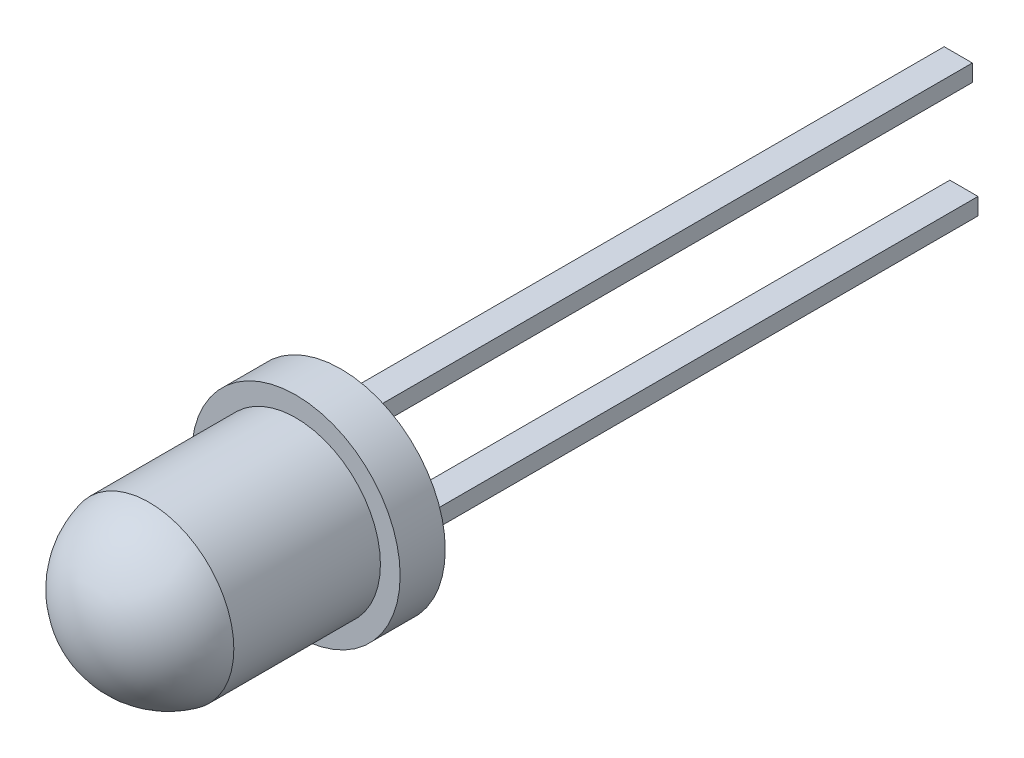
ISO-10303-21;
HEADER;
FILE_DESCRIPTION(('STEP AP214'),'2;1');
FILE_NAME('part.step','',(''),(''),'','','');
FILE_SCHEMA(('AUTOMOTIVE_DESIGN { 1 0 10303 214 1 1 1 1 }'));
ENDSEC;
DATA;
#1=APPLICATION_CONTEXT('core data for automotive mechanical design processes');
#2=APPLICATION_PROTOCOL_DEFINITION('international standard','automotive_design',2000,#1);
#3=PRODUCT_CONTEXT('',#1,'mechanical');
#4=PRODUCT('Part','Part','',(#3));
#5=PRODUCT_RELATED_PRODUCT_CATEGORY('part','',(#4));
#6=PRODUCT_DEFINITION_FORMATION('','',#4);
#7=PRODUCT_DEFINITION_CONTEXT('part definition',#1,'design');
#8=PRODUCT_DEFINITION('design','',#6,#7);
#9=PRODUCT_DEFINITION_SHAPE('','',#8);
#10=(LENGTH_UNIT() NAMED_UNIT(*) SI_UNIT(.MILLI.,.METRE.));
#11=(NAMED_UNIT(*) PLANE_ANGLE_UNIT() SI_UNIT($,.RADIAN.));
#12=(NAMED_UNIT(*) SI_UNIT($,.STERADIAN.) SOLID_ANGLE_UNIT());
#13=UNCERTAINTY_MEASURE_WITH_UNIT(LENGTH_MEASURE(1.E-05),#10,'distance_accuracy_value','');
#14=(GEOMETRIC_REPRESENTATION_CONTEXT(3) GLOBAL_UNCERTAINTY_ASSIGNED_CONTEXT((#13)) GLOBAL_UNIT_ASSIGNED_CONTEXT((#10,
#11,#12)) REPRESENTATION_CONTEXT('',''));
#15=CARTESIAN_POINT('',(0.,0.,0.));
#16=DIRECTION('',(0.,0.,1.));
#17=DIRECTION('',(1.,0.,0.));
#18=AXIS2_PLACEMENT_3D('',#15,#16,#17);
#19=CARTESIAN_POINT('',(0.,0.,1.3));
#20=DIRECTION('',(0.,0.,-1.));
#21=DIRECTION('',(-1.,0.,0.));
#22=AXIS2_PLACEMENT_3D('',#19,#20,#21);
#23=CYLINDRICAL_SURFACE('',#22,1.5);
#24=CARTESIAN_POINT('',(0.,0.,1.3));
#25=DIRECTION('',(0.,0.,1.));
#26=DIRECTION('',(1.,0.,0.));
#27=AXIS2_PLACEMENT_3D('',#24,#25,#26);
#28=CIRCLE('',#27,1.5);
#29=CARTESIAN_POINT('',(1.5,0.,1.3));
#30=VERTEX_POINT('',#29);
#31=EDGE_CURVE('E11',#30,#30,#28,.T.);
#32=ORIENTED_EDGE('',*,*,#31,.F.);
#33=EDGE_LOOP('',(#32));
#34=FACE_BOUND('',#33,.T.);
#35=CARTESIAN_POINT('',(0.,0.,-1.3));
#36=DIRECTION('',(0.,0.,1.));
#37=DIRECTION('',(1.,0.,0.));
#38=AXIS2_PLACEMENT_3D('',#35,#36,#37);
#39=CIRCLE('',#38,1.5);
#40=CARTESIAN_POINT('',(1.5,0.,-1.3));
#41=VERTEX_POINT('',#40);
#42=EDGE_CURVE('E49',#41,#41,#39,.T.);
#43=ORIENTED_EDGE('',*,*,#42,.T.);
#44=EDGE_LOOP('',(#43));
#45=FACE_BOUND('',#44,.T.);
#46=ADVANCED_FACE('F40',(#34,#45),#23,.T.);
#47=CARTESIAN_POINT('',(0.,0.,0.9625));
#48=DIRECTION('',(0.,0.,1.));
#49=DIRECTION('',(1.,0.,0.));
#50=AXIS2_PLACEMENT_3D('',#47,#48,#49);
#51=SPHERICAL_SURFACE('',#50,1.5375);
#52=ORIENTED_EDGE('',*,*,#31,.T.);
#53=EDGE_LOOP('',(#52));
#54=FACE_BOUND('',#53,.T.);
#55=ADVANCED_FACE('F42',(#54),#51,.T.);
#56=CARTESIAN_POINT('',(0.,0.,-2.1));
#57=DIRECTION('',(0.,0.,1.));
#58=DIRECTION('',(1.,0.,0.));
#59=AXIS2_PLACEMENT_3D('',#56,#57,#58);
#60=CYLINDRICAL_SURFACE('',#59,1.85);
#61=CARTESIAN_POINT('',(0.,0.,-2.1));
#62=DIRECTION('',(0.,0.,1.));
#63=DIRECTION('',(1.,0.,0.));
#64=AXIS2_PLACEMENT_3D('',#61,#62,#63);
#65=CIRCLE('',#64,1.85);
#66=CARTESIAN_POINT('',(1.85,0.,-2.1));
#67=VERTEX_POINT('',#66);
#68=EDGE_CURVE('E139',#67,#67,#65,.T.);
#69=ORIENTED_EDGE('',*,*,#68,.T.);
#70=EDGE_LOOP('',(#69));
#71=FACE_BOUND('',#70,.T.);
#72=CARTESIAN_POINT('',(0.,0.,-1.3));
#73=DIRECTION('',(0.,0.,1.));
#74=DIRECTION('',(1.,0.,0.));
#75=AXIS2_PLACEMENT_3D('',#72,#73,#74);
#76=CIRCLE('',#75,1.85);
#77=CARTESIAN_POINT('',(1.85,0.,-1.3));
#78=VERTEX_POINT('',#77);
#79=EDGE_CURVE('E143',#78,#78,#76,.T.);
#80=ORIENTED_EDGE('',*,*,#79,.F.);
#81=EDGE_LOOP('',(#80));
#82=FACE_BOUND('',#81,.T.);
#83=ADVANCED_FACE('F158',(#71,#82),#60,.T.);
#84=CARTESIAN_POINT('',(0.,0.,-2.1));
#85=DIRECTION('',(0.,0.,1.));
#86=DIRECTION('',(1.,0.,0.));
#87=AXIS2_PLACEMENT_3D('',#84,#85,#86);
#88=PLANE('',#87);
#89=DIRECTION('',(0.,-1.,0.));
#90=VECTOR('',#89,1.);
#91=CARTESIAN_POINT('',(-1.3,0.,-2.1));
#92=LINE('',#91,#90);
#93=CARTESIAN_POINT('',(-1.3,0.15,-2.1));
#94=VERTEX_POINT('',#93);
#95=CARTESIAN_POINT('',(-1.3,-0.15,-2.1));
#96=VERTEX_POINT('',#95);
#97=EDGE_CURVE('E315',#94,#96,#92,.T.);
#98=ORIENTED_EDGE('',*,*,#97,.T.);
#99=DIRECTION('',(1.,0.,0.));
#100=VECTOR('',#99,1.);
#101=CARTESIAN_POINT('',(0.,-0.15,-2.1));
#102=LINE('',#101,#100);
#103=CARTESIAN_POINT('',(-0.8,-0.15,-2.1));
#104=VERTEX_POINT('',#103);
#105=EDGE_CURVE('E326',#96,#104,#102,.T.);
#106=ORIENTED_EDGE('',*,*,#105,.T.);
#107=DIRECTION('',(0.,1.,0.));
#108=VECTOR('',#107,1.);
#109=CARTESIAN_POINT('',(-0.8,0.,-2.1));
#110=LINE('',#109,#108);
#111=CARTESIAN_POINT('',(-0.8,0.15,-2.1));
#112=VERTEX_POINT('',#111);
#113=EDGE_CURVE('E322',#104,#112,#110,.T.);
#114=ORIENTED_EDGE('',*,*,#113,.T.);
#115=DIRECTION('',(-1.,0.,0.));
#116=VECTOR('',#115,1.);
#117=CARTESIAN_POINT('',(0.,0.15,-2.1));
#118=LINE('',#117,#116);
#119=EDGE_CURVE('E64',#112,#94,#118,.T.);
#120=ORIENTED_EDGE('',*,*,#119,.T.);
#121=EDGE_LOOP('',(#98,#106,#114,#120));
#122=FACE_BOUND('',#121,.T.);
#123=DIRECTION('',(0.,-1.,0.));
#124=VECTOR('',#123,1.);
#125=CARTESIAN_POINT('',(0.8,0.,-2.1));
#126=LINE('',#125,#124);
#127=CARTESIAN_POINT('',(0.8,0.15,-2.1));
#128=VERTEX_POINT('',#127);
#129=CARTESIAN_POINT('',(0.8,-0.15,-2.1));
#130=VERTEX_POINT('',#129);
#131=EDGE_CURVE('E128',#128,#130,#126,.T.);
#132=ORIENTED_EDGE('',*,*,#131,.T.);
#133=DIRECTION('',(1.,0.,0.));
#134=VECTOR('',#133,1.);
#135=CARTESIAN_POINT('',(0.,-0.15,-2.1));
#136=LINE('',#135,#134);
#137=CARTESIAN_POINT('',(1.3,-0.15,-2.1));
#138=VERTEX_POINT('',#137);
#139=EDGE_CURVE('E299',#130,#138,#136,.T.);
#140=ORIENTED_EDGE('',*,*,#139,.T.);
#141=DIRECTION('',(0.,1.,0.));
#142=VECTOR('',#141,1.);
#143=CARTESIAN_POINT('',(1.3,0.,-2.1));
#144=LINE('',#143,#142);
#145=CARTESIAN_POINT('',(1.3,0.15,-2.1));
#146=VERTEX_POINT('',#145);
#147=EDGE_CURVE('E124',#138,#146,#144,.T.);
#148=ORIENTED_EDGE('',*,*,#147,.T.);
#149=DIRECTION('',(-1.,0.,0.));
#150=VECTOR('',#149,1.);
#151=CARTESIAN_POINT('',(0.,0.15,-2.1));
#152=LINE('',#151,#150);
#153=EDGE_CURVE('E135',#146,#128,#152,.T.);
#154=ORIENTED_EDGE('',*,*,#153,.T.);
#155=EDGE_LOOP('',(#132,#140,#148,#154));
#156=FACE_BOUND('',#155,.T.);
#157=ORIENTED_EDGE('',*,*,#68,.F.);
#158=EDGE_LOOP('',(#157));
#159=FACE_BOUND('',#158,.T.);
#160=ADVANCED_FACE('F154',(#122,#156,#159),#88,.F.);
#161=CARTESIAN_POINT('',(0.,0.,-1.3));
#162=DIRECTION('',(0.,0.,1.));
#163=DIRECTION('',(1.,0.,0.));
#164=AXIS2_PLACEMENT_3D('',#161,#162,#163);
#165=PLANE('',#164);
#166=ORIENTED_EDGE('',*,*,#42,.F.);
#167=EDGE_LOOP('',(#166));
#168=FACE_BOUND('',#167,.T.);
#169=ORIENTED_EDGE('',*,*,#79,.T.);
#170=EDGE_LOOP('',(#169));
#171=FACE_BOUND('',#170,.T.);
#172=ADVANCED_FACE('F151',(#168,#171),#165,.T.);
#173=CARTESIAN_POINT('',(0.,-0.15,-14.1));
#174=DIRECTION('',(0.,-1.,0.));
#175=DIRECTION('',(1.,0.,0.));
#176=AXIS2_PLACEMENT_3D('',#173,#174,#175);
#177=PLANE('',#176);
#178=DIRECTION('',(1.,0.,0.));
#179=VECTOR('',#178,1.);
#180=CARTESIAN_POINT('',(0.,-0.15,-12.1));
#181=LINE('',#180,#179);
#182=CARTESIAN_POINT('',(0.8,-0.15,-12.1));
#183=VERTEX_POINT('',#182);
#184=CARTESIAN_POINT('',(1.3,-0.15,-12.1));
#185=VERTEX_POINT('',#184);
#186=EDGE_CURVE('E106',#183,#185,#181,.T.);
#187=ORIENTED_EDGE('',*,*,#186,.T.);
#188=DIRECTION('',(0.,0.,1.));
#189=VECTOR('',#188,1.);
#190=CARTESIAN_POINT('',(1.3,-0.15,-14.1));
#191=LINE('',#190,#189);
#192=EDGE_CURVE('E117',#185,#138,#191,.T.);
#193=ORIENTED_EDGE('',*,*,#192,.T.);
#194=ORIENTED_EDGE('',*,*,#139,.F.);
#195=DIRECTION('',(0.,0.,1.));
#196=VECTOR('',#195,1.);
#197=CARTESIAN_POINT('',(0.8,-0.15,-14.1));
#198=LINE('',#197,#196);
#199=EDGE_CURVE('E119',#183,#130,#198,.T.);
#200=ORIENTED_EDGE('',*,*,#199,.F.);
#201=EDGE_LOOP('',(#187,#193,#194,#200));
#202=FACE_BOUND('',#201,.T.);
#203=ADVANCED_FACE('F115',(#202),#177,.T.);
#204=CARTESIAN_POINT('',(0.8,0.,-14.1));
#205=DIRECTION('',(-1.,0.,0.));
#206=DIRECTION('',(0.,0.,1.));
#207=AXIS2_PLACEMENT_3D('',#204,#205,#206);
#208=PLANE('',#207);
#209=DIRECTION('',(0.,-1.,0.));
#210=VECTOR('',#209,1.);
#211=CARTESIAN_POINT('',(0.8,0.,-12.1));
#212=LINE('',#211,#210);
#213=CARTESIAN_POINT('',(0.8,0.15,-12.1));
#214=VERTEX_POINT('',#213);
#215=EDGE_CURVE('E288',#214,#183,#212,.T.);
#216=ORIENTED_EDGE('',*,*,#215,.T.);
#217=ORIENTED_EDGE('',*,*,#199,.T.);
#218=ORIENTED_EDGE('',*,*,#131,.F.);
#219=DIRECTION('',(0.,0.,1.));
#220=VECTOR('',#219,1.);
#221=CARTESIAN_POINT('',(0.8,0.15,-14.1));
#222=LINE('',#221,#220);
#223=EDGE_CURVE('E132',#214,#128,#222,.T.);
#224=ORIENTED_EDGE('',*,*,#223,.F.);
#225=EDGE_LOOP('',(#216,#217,#218,#224));
#226=FACE_BOUND('',#225,.T.);
#227=ADVANCED_FACE('F249',(#226),#208,.T.);
#228=CARTESIAN_POINT('',(0.,0.15,-14.1));
#229=DIRECTION('',(0.,1.,0.));
#230=DIRECTION('',(-1.,0.,0.));
#231=AXIS2_PLACEMENT_3D('',#228,#229,#230);
#232=PLANE('',#231);
#233=DIRECTION('',(-1.,0.,0.));
#234=VECTOR('',#233,1.);
#235=CARTESIAN_POINT('',(0.,0.15,-12.1));
#236=LINE('',#235,#234);
#237=CARTESIAN_POINT('',(1.3,0.15,-12.1));
#238=VERTEX_POINT('',#237);
#239=EDGE_CURVE('E56',#238,#214,#236,.T.);
#240=ORIENTED_EDGE('',*,*,#239,.T.);
#241=ORIENTED_EDGE('',*,*,#223,.T.);
#242=ORIENTED_EDGE('',*,*,#153,.F.);
#243=DIRECTION('',(0.,0.,1.));
#244=VECTOR('',#243,1.);
#245=CARTESIAN_POINT('',(1.3,0.15,-14.1));
#246=LINE('',#245,#244);
#247=EDGE_CURVE('E127',#238,#146,#246,.T.);
#248=ORIENTED_EDGE('',*,*,#247,.F.);
#249=EDGE_LOOP('',(#240,#241,#242,#248));
#250=FACE_BOUND('',#249,.T.);
#251=ADVANCED_FACE('F258',(#250),#232,.T.);
#252=CARTESIAN_POINT('',(1.3,0.,-14.1));
#253=DIRECTION('',(1.,0.,0.));
#254=DIRECTION('',(0.,0.,-1.));
#255=AXIS2_PLACEMENT_3D('',#252,#253,#254);
#256=PLANE('',#255);
#257=DIRECTION('',(0.,1.,0.));
#258=VECTOR('',#257,1.);
#259=CARTESIAN_POINT('',(1.3,0.,-12.1));
#260=LINE('',#259,#258);
#261=EDGE_CURVE('E103',#185,#238,#260,.T.);
#262=ORIENTED_EDGE('',*,*,#261,.T.);
#263=ORIENTED_EDGE('',*,*,#247,.T.);
#264=ORIENTED_EDGE('',*,*,#147,.F.);
#265=ORIENTED_EDGE('',*,*,#192,.F.);
#266=EDGE_LOOP('',(#262,#263,#264,#265));
#267=FACE_BOUND('',#266,.T.);
#268=ADVANCED_FACE('F122',(#267),#256,.T.);
#269=CARTESIAN_POINT('',(0.,-0.15,-14.1));
#270=DIRECTION('',(0.,-1.,0.));
#271=DIRECTION('',(1.,0.,0.));
#272=AXIS2_PLACEMENT_3D('',#269,#270,#271);
#273=PLANE('',#272);
#274=ORIENTED_EDGE('',*,*,#105,.F.);
#275=DIRECTION('',(0.,0.,1.));
#276=VECTOR('',#275,1.);
#277=CARTESIAN_POINT('',(-1.3,-0.15,-14.1));
#278=LINE('',#277,#276);
#279=CARTESIAN_POINT('',(-1.3,-0.15,-14.1));
#280=VERTEX_POINT('',#279);
#281=EDGE_CURVE('E302',#280,#96,#278,.T.);
#282=ORIENTED_EDGE('',*,*,#281,.F.);
#283=DIRECTION('',(1.,0.,0.));
#284=VECTOR('',#283,1.);
#285=CARTESIAN_POINT('',(0.,-0.15,-14.1));
#286=LINE('',#285,#284);
#287=CARTESIAN_POINT('',(-0.8,-0.15,-14.1));
#288=VERTEX_POINT('',#287);
#289=EDGE_CURVE('E319',#280,#288,#286,.T.);
#290=ORIENTED_EDGE('',*,*,#289,.T.);
#291=DIRECTION('',(0.,0.,1.));
#292=VECTOR('',#291,1.);
#293=CARTESIAN_POINT('',(-0.8,-0.15,-14.1));
#294=LINE('',#293,#292);
#295=EDGE_CURVE('E303',#288,#104,#294,.T.);
#296=ORIENTED_EDGE('',*,*,#295,.T.);
#297=EDGE_LOOP('',(#274,#282,#290,#296));
#298=FACE_BOUND('',#297,.T.);
#299=ADVANCED_FACE('F193',(#298),#273,.T.);
#300=CARTESIAN_POINT('',(-1.3,0.,-14.1));
#301=DIRECTION('',(-1.,0.,0.));
#302=DIRECTION('',(0.,0.,1.));
#303=AXIS2_PLACEMENT_3D('',#300,#301,#302);
#304=PLANE('',#303);
#305=ORIENTED_EDGE('',*,*,#97,.F.);
#306=DIRECTION('',(0.,0.,1.));
#307=VECTOR('',#306,1.);
#308=CARTESIAN_POINT('',(-1.3,0.15,-14.1));
#309=LINE('',#308,#307);
#310=CARTESIAN_POINT('',(-1.3,0.15,-14.1));
#311=VERTEX_POINT('',#310);
#312=EDGE_CURVE('E310',#311,#94,#309,.T.);
#313=ORIENTED_EDGE('',*,*,#312,.F.);
#314=DIRECTION('',(0.,-1.,0.));
#315=VECTOR('',#314,1.);
#316=CARTESIAN_POINT('',(-1.3,0.,-14.1));
#317=LINE('',#316,#315);
#318=EDGE_CURVE('E307',#311,#280,#317,.T.);
#319=ORIENTED_EDGE('',*,*,#318,.T.);
#320=ORIENTED_EDGE('',*,*,#281,.T.);
#321=EDGE_LOOP('',(#305,#313,#319,#320));
#322=FACE_BOUND('',#321,.T.);
#323=ADVANCED_FACE('F198',(#322),#304,.T.);
#324=CARTESIAN_POINT('',(0.,0.15,-14.1));
#325=DIRECTION('',(0.,1.,0.));
#326=DIRECTION('',(-1.,0.,0.));
#327=AXIS2_PLACEMENT_3D('',#324,#325,#326);
#328=PLANE('',#327);
#329=ORIENTED_EDGE('',*,*,#119,.F.);
#330=DIRECTION('',(0.,0.,1.));
#331=VECTOR('',#330,1.);
#332=CARTESIAN_POINT('',(-0.8,0.15,-14.1));
#333=LINE('',#332,#331);
#334=CARTESIAN_POINT('',(-0.8,0.15,-14.1));
#335=VERTEX_POINT('',#334);
#336=EDGE_CURVE('E306',#335,#112,#333,.T.);
#337=ORIENTED_EDGE('',*,*,#336,.F.);
#338=DIRECTION('',(-1.,0.,0.));
#339=VECTOR('',#338,1.);
#340=CARTESIAN_POINT('',(0.,0.15,-14.1));
#341=LINE('',#340,#339);
#342=EDGE_CURVE('E333',#335,#311,#341,.T.);
#343=ORIENTED_EDGE('',*,*,#342,.T.);
#344=ORIENTED_EDGE('',*,*,#312,.T.);
#345=EDGE_LOOP('',(#329,#337,#343,#344));
#346=FACE_BOUND('',#345,.T.);
#347=ADVANCED_FACE('F210',(#346),#328,.T.);
#348=CARTESIAN_POINT('',(-0.8,0.,-14.1));
#349=DIRECTION('',(1.,0.,0.));
#350=DIRECTION('',(0.,0.,-1.));
#351=AXIS2_PLACEMENT_3D('',#348,#349,#350);
#352=PLANE('',#351);
#353=ORIENTED_EDGE('',*,*,#113,.F.);
#354=ORIENTED_EDGE('',*,*,#295,.F.);
#355=DIRECTION('',(0.,1.,0.));
#356=VECTOR('',#355,1.);
#357=CARTESIAN_POINT('',(-0.8,0.,-14.1));
#358=LINE('',#357,#356);
#359=EDGE_CURVE('E337',#288,#335,#358,.T.);
#360=ORIENTED_EDGE('',*,*,#359,.T.);
#361=ORIENTED_EDGE('',*,*,#336,.T.);
#362=EDGE_LOOP('',(#353,#354,#360,#361));
#363=FACE_BOUND('',#362,.T.);
#364=ADVANCED_FACE('F220',(#363),#352,.T.);
#365=CARTESIAN_POINT('',(0.,0.,-14.1));
#366=DIRECTION('',(0.,0.,1.));
#367=DIRECTION('',(1.,0.,0.));
#368=AXIS2_PLACEMENT_3D('',#365,#366,#367);
#369=PLANE('',#368);
#370=ORIENTED_EDGE('',*,*,#289,.F.);
#371=ORIENTED_EDGE('',*,*,#318,.F.);
#372=ORIENTED_EDGE('',*,*,#342,.F.);
#373=ORIENTED_EDGE('',*,*,#359,.F.);
#374=EDGE_LOOP('',(#370,#371,#372,#373));
#375=FACE_BOUND('',#374,.T.);
#376=ADVANCED_FACE('F229',(#375),#369,.F.);
#377=CARTESIAN_POINT('',(0.,0.,-12.1));
#378=DIRECTION('',(0.,0.,1.));
#379=DIRECTION('',(1.,0.,0.));
#380=AXIS2_PLACEMENT_3D('',#377,#378,#379);
#381=PLANE('',#380);
#382=ORIENTED_EDGE('',*,*,#186,.F.);
#383=ORIENTED_EDGE('',*,*,#215,.F.);
#384=ORIENTED_EDGE('',*,*,#239,.F.);
#385=ORIENTED_EDGE('',*,*,#261,.F.);
#386=EDGE_LOOP('',(#382,#383,#384,#385));
#387=FACE_BOUND('',#386,.T.);
#388=ADVANCED_FACE('F105',(#387),#381,.F.);
#389=CLOSED_SHELL('',(#46,#55,#83,#160,#172,#203,#227,#251,#268,#299,#323,#347,#364,#376,#388));
#390=MANIFOLD_SOLID_BREP('B2',#389);
#391=ADVANCED_BREP_SHAPE_REPRESENTATION('',(#18,#390),#14);
#392=SHAPE_DEFINITION_REPRESENTATION(#9,#391);
ENDSEC;
END-ISO-10303-21;
